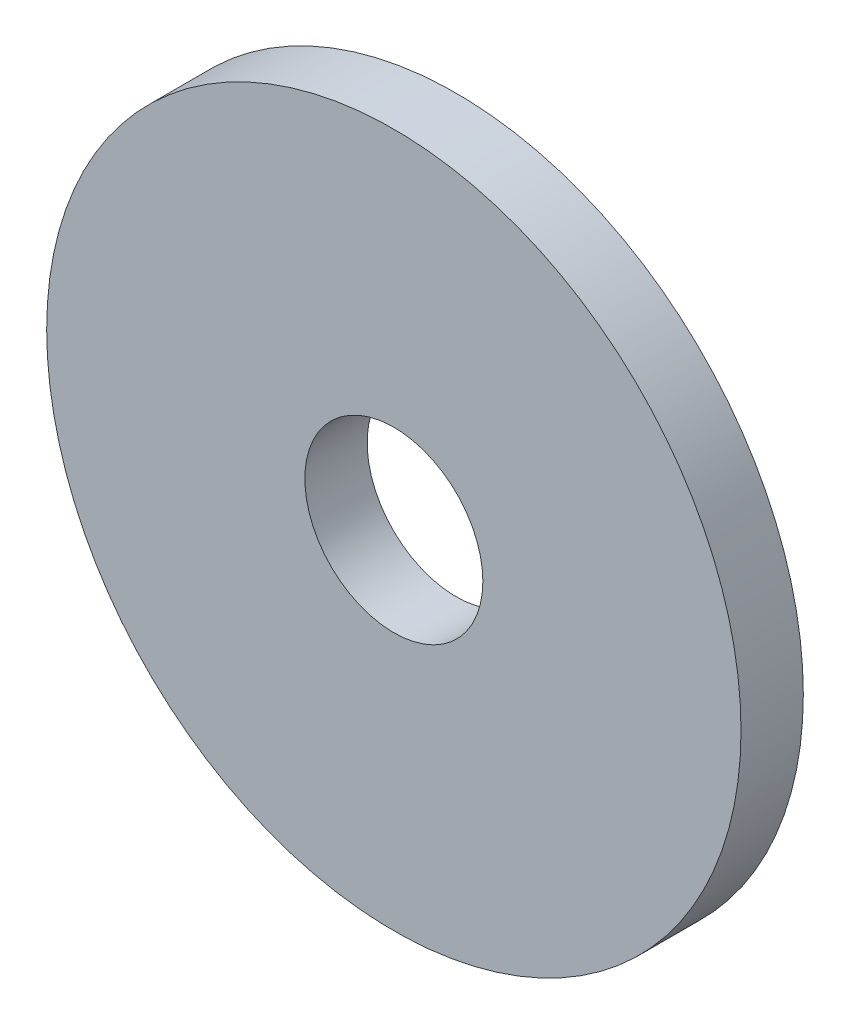
ISO-10303-21;
HEADER;
FILE_DESCRIPTION(('STEP AP214'),'2;1');
FILE_NAME('part.step','',(''),(''),'','','');
FILE_SCHEMA(('AUTOMOTIVE_DESIGN { 1 0 10303 214 1 1 1 1 }'));
ENDSEC;
DATA;
#1=APPLICATION_CONTEXT('core data for automotive mechanical design processes');
#2=APPLICATION_PROTOCOL_DEFINITION('international standard','automotive_design',2000,#1);
#3=PRODUCT_CONTEXT('',#1,'mechanical');
#4=PRODUCT('Part','Part','',(#3));
#5=PRODUCT_RELATED_PRODUCT_CATEGORY('part','',(#4));
#6=PRODUCT_DEFINITION_FORMATION('','',#4);
#7=PRODUCT_DEFINITION_CONTEXT('part definition',#1,'design');
#8=PRODUCT_DEFINITION('design','',#6,#7);
#9=PRODUCT_DEFINITION_SHAPE('','',#8);
#10=(LENGTH_UNIT() NAMED_UNIT(*) SI_UNIT(.MILLI.,.METRE.));
#11=(NAMED_UNIT(*) PLANE_ANGLE_UNIT() SI_UNIT($,.RADIAN.));
#12=(NAMED_UNIT(*) SI_UNIT($,.STERADIAN.) SOLID_ANGLE_UNIT());
#13=UNCERTAINTY_MEASURE_WITH_UNIT(LENGTH_MEASURE(1.E-05),#10,'distance_accuracy_value','');
#14=(GEOMETRIC_REPRESENTATION_CONTEXT(3) GLOBAL_UNCERTAINTY_ASSIGNED_CONTEXT((#13)) GLOBAL_UNIT_ASSIGNED_CONTEXT((#10,
#11,#12)) REPRESENTATION_CONTEXT('',''));
#15=CARTESIAN_POINT('',(0.,0.,0.));
#16=DIRECTION('',(0.,0.,1.));
#17=DIRECTION('',(1.,0.,0.));
#18=AXIS2_PLACEMENT_3D('',#15,#16,#17);
#19=CARTESIAN_POINT('',(0.,0.,0.6223));
#20=DIRECTION('',(0.,0.,1.));
#21=DIRECTION('',(1.,0.,0.));
#22=AXIS2_PLACEMENT_3D('',#19,#20,#21);
#23=PLANE('',#22);
#24=CARTESIAN_POINT('',(0.,0.,0.6223));
#25=DIRECTION('',(0.,0.,1.));
#26=DIRECTION('',(1.,0.,0.));
#27=AXIS2_PLACEMENT_3D('',#24,#25,#26);
#28=CIRCLE('',#27,3.4671);
#29=CARTESIAN_POINT('',(3.4671,0.,0.6223));
#30=VERTEX_POINT('',#29);
#31=EDGE_CURVE('E10',#30,#30,#28,.T.);
#32=ORIENTED_EDGE('',*,*,#31,.T.);
#33=EDGE_LOOP('',(#32));
#34=FACE_BOUND('',#33,.T.);
#35=CARTESIAN_POINT('',(0.,0.,0.6223));
#36=DIRECTION('',(0.,0.,1.));
#37=DIRECTION('',(1.,0.,0.));
#38=AXIS2_PLACEMENT_3D('',#35,#36,#37);
#39=CIRCLE('',#38,0.889);
#40=CARTESIAN_POINT('',(0.889,0.,0.6223));
#41=VERTEX_POINT('',#40);
#42=EDGE_CURVE('E46',#41,#41,#39,.T.);
#43=ORIENTED_EDGE('',*,*,#42,.F.);
#44=EDGE_LOOP('',(#43));
#45=FACE_BOUND('',#44,.T.);
#46=ADVANCED_FACE('F35',(#34,#45),#23,.T.);
#47=CARTESIAN_POINT('',(0.,0.,0.));
#48=DIRECTION('',(0.,0.,1.));
#49=DIRECTION('',(1.,0.,0.));
#50=AXIS2_PLACEMENT_3D('',#47,#48,#49);
#51=PLANE('',#50);
#52=CARTESIAN_POINT('',(0.,0.,0.));
#53=DIRECTION('',(0.,0.,1.));
#54=DIRECTION('',(1.,0.,0.));
#55=AXIS2_PLACEMENT_3D('',#52,#53,#54);
#56=CIRCLE('',#55,3.4671);
#57=CARTESIAN_POINT('',(3.4671,0.,0.));
#58=VERTEX_POINT('',#57);
#59=EDGE_CURVE('E39',#58,#58,#56,.T.);
#60=ORIENTED_EDGE('',*,*,#59,.F.);
#61=EDGE_LOOP('',(#60));
#62=FACE_BOUND('',#61,.T.);
#63=CARTESIAN_POINT('',(0.,0.,0.));
#64=DIRECTION('',(0.,0.,1.));
#65=DIRECTION('',(1.,0.,0.));
#66=AXIS2_PLACEMENT_3D('',#63,#64,#65);
#67=CIRCLE('',#66,0.889);
#68=CARTESIAN_POINT('',(0.889,0.,0.));
#69=VERTEX_POINT('',#68);
#70=EDGE_CURVE('E48',#69,#69,#67,.T.);
#71=ORIENTED_EDGE('',*,*,#70,.T.);
#72=EDGE_LOOP('',(#71));
#73=FACE_BOUND('',#72,.T.);
#74=ADVANCED_FACE('F58',(#62,#73),#51,.F.);
#75=CARTESIAN_POINT('',(0.,0.,0.6223));
#76=DIRECTION('',(0.,0.,-1.));
#77=DIRECTION('',(-1.,0.,0.));
#78=AXIS2_PLACEMENT_3D('',#75,#76,#77);
#79=CYLINDRICAL_SURFACE('',#78,3.4671);
#80=ORIENTED_EDGE('',*,*,#31,.F.);
#81=EDGE_LOOP('',(#80));
#82=FACE_BOUND('',#81,.T.);
#83=ORIENTED_EDGE('',*,*,#59,.T.);
#84=EDGE_LOOP('',(#83));
#85=FACE_BOUND('',#84,.T.);
#86=ADVANCED_FACE('F37',(#82,#85),#79,.T.);
#87=CARTESIAN_POINT('',(0.,0.,0.6223));
#88=DIRECTION('',(0.,0.,-1.));
#89=DIRECTION('',(-1.,0.,0.));
#90=AXIS2_PLACEMENT_3D('',#87,#88,#89);
#91=CYLINDRICAL_SURFACE('',#90,0.889);
#92=ORIENTED_EDGE('',*,*,#42,.T.);
#93=EDGE_LOOP('',(#92));
#94=FACE_BOUND('',#93,.T.);
#95=ORIENTED_EDGE('',*,*,#70,.F.);
#96=EDGE_LOOP('',(#95));
#97=FACE_BOUND('',#96,.T.);
#98=ADVANCED_FACE('F54',(#94,#97),#91,.F.);
#99=CLOSED_SHELL('',(#46,#74,#86,#98));
#100=MANIFOLD_SOLID_BREP('B2',#99);
#101=ADVANCED_BREP_SHAPE_REPRESENTATION('',(#18,#100),#14);
#102=SHAPE_DEFINITION_REPRESENTATION(#9,#101);
ENDSEC;
END-ISO-10303-21;
